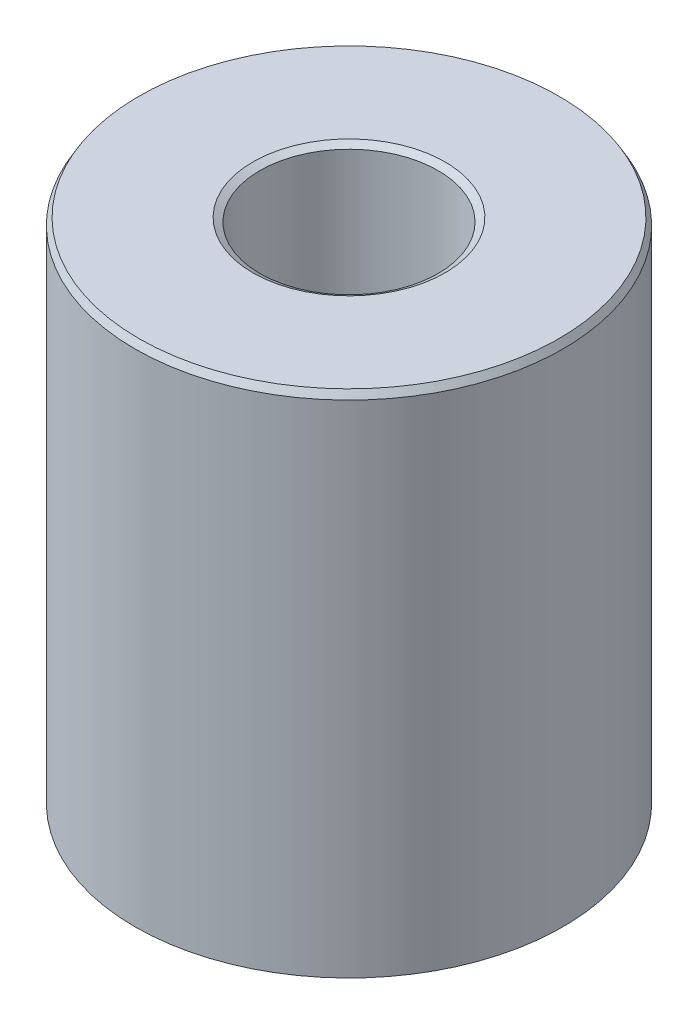
ISO-10303-21;
HEADER;
FILE_DESCRIPTION(('STEP AP214'),'2;1');
FILE_NAME('part.step','',(''),(''),'','','');
FILE_SCHEMA(('AUTOMOTIVE_DESIGN { 1 0 10303 214 1 1 1 1 }'));
ENDSEC;
DATA;
#1=APPLICATION_CONTEXT('core data for automotive mechanical design processes');
#2=APPLICATION_PROTOCOL_DEFINITION('international standard','automotive_design',2000,#1);
#3=PRODUCT_CONTEXT('',#1,'mechanical');
#4=PRODUCT('Part','Part','',(#3));
#5=PRODUCT_RELATED_PRODUCT_CATEGORY('part','',(#4));
#6=PRODUCT_DEFINITION_FORMATION('','',#4);
#7=PRODUCT_DEFINITION_CONTEXT('part definition',#1,'design');
#8=PRODUCT_DEFINITION('design','',#6,#7);
#9=PRODUCT_DEFINITION_SHAPE('','',#8);
#10=(LENGTH_UNIT() NAMED_UNIT(*) SI_UNIT(.MILLI.,.METRE.));
#11=(NAMED_UNIT(*) PLANE_ANGLE_UNIT() SI_UNIT($,.RADIAN.));
#12=(NAMED_UNIT(*) SI_UNIT($,.STERADIAN.) SOLID_ANGLE_UNIT());
#13=UNCERTAINTY_MEASURE_WITH_UNIT(LENGTH_MEASURE(1.E-05),#10,'distance_accuracy_value','');
#14=(GEOMETRIC_REPRESENTATION_CONTEXT(3) GLOBAL_UNCERTAINTY_ASSIGNED_CONTEXT((#13)) GLOBAL_UNIT_ASSIGNED_CONTEXT((#10,
#11,#12)) REPRESENTATION_CONTEXT('',''));
#15=CARTESIAN_POINT('',(0.,0.,0.));
#16=DIRECTION('',(0.,0.,1.));
#17=DIRECTION('',(1.,0.,0.));
#18=AXIS2_PLACEMENT_3D('',#15,#16,#17);
#19=CARTESIAN_POINT('',(0.,101.568319174673,0.));
#20=DIRECTION('',(0.,-1.,0.));
#21=DIRECTION('',(0.,0.,-1.));
#22=AXIS2_PLACEMENT_3D('',#19,#20,#21);
#23=CYLINDRICAL_SURFACE('',#22,42.5);
#24=CARTESIAN_POINT('',(0.,0.796338501359004,0.));
#25=DIRECTION('',(0.,1.,0.));
#26=DIRECTION('',(0.,0.,1.));
#27=AXIS2_PLACEMENT_3D('',#24,#25,#26);
#28=CIRCLE('',#27,42.5);
#29=CARTESIAN_POINT('',(0.,0.796338501359004,42.5));
#30=VERTEX_POINT('',#29);
#31=EDGE_CURVE('E10',#30,#30,#28,.T.);
#32=ORIENTED_EDGE('',*,*,#31,.T.);
#33=EDGE_LOOP('',(#32));
#34=FACE_BOUND('',#33,.T.);
#35=CARTESIAN_POINT('',(0.,100.189020430296,0.));
#36=DIRECTION('',(0.,1.,0.));
#37=DIRECTION('',(0.,0.,1.));
#38=AXIS2_PLACEMENT_3D('',#35,#36,#37);
#39=CIRCLE('',#38,42.5);
#40=CARTESIAN_POINT('',(0.,100.189020430296,42.5));
#41=VERTEX_POINT('',#40);
#42=EDGE_CURVE('E50',#41,#41,#39,.F.);
#43=ORIENTED_EDGE('',*,*,#42,.T.);
#44=EDGE_LOOP('',(#43));
#45=FACE_BOUND('',#44,.T.);
#46=ADVANCED_FACE('F39',(#34,#45),#23,.T.);
#47=CARTESIAN_POINT('',(0.,101.568319174673,0.));
#48=DIRECTION('',(0.,1.,0.));
#49=DIRECTION('',(0.,0.,1.));
#50=AXIS2_PLACEMENT_3D('',#47,#48,#49);
#51=PLANE('',#50);
#52=CARTESIAN_POINT('',(0.,101.568319174673,0.));
#53=DIRECTION('',(0.,1.,0.));
#54=DIRECTION('',(0.,0.,1.));
#55=AXIS2_PLACEMENT_3D('',#52,#53,#54);
#56=CIRCLE('',#55,19.0885560058436);
#57=CARTESIAN_POINT('',(0.,101.568319174673,19.0885560058436));
#58=VERTEX_POINT('',#57);
#59=EDGE_CURVE('E58',#58,#58,#56,.F.);
#60=ORIENTED_EDGE('',*,*,#59,.T.);
#61=EDGE_LOOP('',(#60));
#62=FACE_BOUND('',#61,.T.);
#63=CARTESIAN_POINT('',(0.,101.568319174673,0.));
#64=DIRECTION('',(0.,1.,0.));
#65=DIRECTION('',(0.,0.,1.));
#66=AXIS2_PLACEMENT_3D('',#63,#64,#65);
#67=CIRCLE('',#66,41.7036614986409);
#68=CARTESIAN_POINT('',(0.,101.568319174673,41.7036614986409));
#69=VERTEX_POINT('',#68);
#70=EDGE_CURVE('E61',#69,#69,#67,.T.);
#71=ORIENTED_EDGE('',*,*,#70,.T.);
#72=EDGE_LOOP('',(#71));
#73=FACE_BOUND('',#72,.T.);
#74=ADVANCED_FACE('F88',(#62,#73),#51,.T.);
#75=CARTESIAN_POINT('',(0.,0.,0.));
#76=DIRECTION('',(0.,1.,0.));
#77=DIRECTION('',(0.,0.,1.));
#78=AXIS2_PLACEMENT_3D('',#75,#76,#77);
#79=PLANE('',#78);
#80=CARTESIAN_POINT('',(0.,0.,0.));
#81=DIRECTION('',(0.,1.,0.));
#82=DIRECTION('',(0.,0.,1.));
#83=AXIS2_PLACEMENT_3D('',#80,#81,#82);
#84=CIRCLE('',#83,18.5055957628256);
#85=CARTESIAN_POINT('',(0.,0.,18.5055957628256));
#86=VERTEX_POINT('',#85);
#87=EDGE_CURVE('E51',#86,#86,#84,.T.);
#88=ORIENTED_EDGE('',*,*,#87,.T.);
#89=EDGE_LOOP('',(#88));
#90=FACE_BOUND('',#89,.T.);
#91=CARTESIAN_POINT('',(0.,0.,0.));
#92=DIRECTION('',(0.,1.,0.));
#93=DIRECTION('',(0.,0.,1.));
#94=AXIS2_PLACEMENT_3D('',#91,#92,#93);
#95=CIRCLE('',#94,41.1207012556229);
#96=CARTESIAN_POINT('',(0.,0.,41.1207012556229));
#97=VERTEX_POINT('',#96);
#98=EDGE_CURVE('E54',#97,#97,#95,.F.);
#99=ORIENTED_EDGE('',*,*,#98,.T.);
#100=EDGE_LOOP('',(#99));
#101=FACE_BOUND('',#100,.T.);
#102=ADVANCED_FACE('F83',(#90,#101),#79,.F.);
#103=CARTESIAN_POINT('',(0.,101.568319174673,0.));
#104=DIRECTION('',(0.,-1.,0.));
#105=DIRECTION('',(0.,0.,-1.));
#106=AXIS2_PLACEMENT_3D('',#103,#104,#105);
#107=CYLINDRICAL_SURFACE('',#106,17.7092572614666);
#108=CARTESIAN_POINT('',(0.,100.771980673314,0.));
#109=DIRECTION('',(0.,1.,0.));
#110=DIRECTION('',(0.,0.,1.));
#111=AXIS2_PLACEMENT_3D('',#108,#109,#110);
#112=CIRCLE('',#111,17.7092572614666);
#113=CARTESIAN_POINT('',(0.,100.771980673314,17.7092572614666));
#114=VERTEX_POINT('',#113);
#115=EDGE_CURVE('E67',#114,#114,#112,.T.);
#116=ORIENTED_EDGE('',*,*,#115,.T.);
#117=EDGE_LOOP('',(#116));
#118=FACE_BOUND('',#117,.T.);
#119=CARTESIAN_POINT('',(0.,1.3792987443771,0.));
#120=DIRECTION('',(0.,1.,0.));
#121=DIRECTION('',(0.,0.,1.));
#122=AXIS2_PLACEMENT_3D('',#119,#120,#121);
#123=CIRCLE('',#122,17.7092572614666);
#124=CARTESIAN_POINT('',(0.,1.3792987443771,17.7092572614666));
#125=VERTEX_POINT('',#124);
#126=EDGE_CURVE('E69',#125,#125,#123,.F.);
#127=ORIENTED_EDGE('',*,*,#126,.T.);
#128=EDGE_LOOP('',(#127));
#129=FACE_BOUND('',#128,.T.);
#130=ADVANCED_FACE('F71',(#118,#129),#107,.F.);
#131=CARTESIAN_POINT('',(0.,100.771980673314,0.));
#132=DIRECTION('',(0.,1.,0.));
#133=DIRECTION('',(0.,0.,1.));
#134=AXIS2_PLACEMENT_3D('',#131,#132,#133);
#135=CONICAL_SURFACE('',#134,17.7092572614666,1.04719755119659);
#136=ORIENTED_EDGE('',*,*,#59,.F.);
#137=EDGE_LOOP('',(#136));
#138=FACE_BOUND('',#137,.T.);
#139=ORIENTED_EDGE('',*,*,#115,.F.);
#140=EDGE_LOOP('',(#139));
#141=FACE_BOUND('',#140,.T.);
#142=ADVANCED_FACE('F77',(#138,#141),#135,.F.);
#143=CARTESIAN_POINT('',(0.,0.,0.));
#144=DIRECTION('',(0.,-1.,0.));
#145=DIRECTION('',(0.,0.,-1.));
#146=AXIS2_PLACEMENT_3D('',#143,#144,#145);
#147=CONICAL_SURFACE('',#146,18.5055957628256,0.523598775598294);
#148=ORIENTED_EDGE('',*,*,#126,.F.);
#149=EDGE_LOOP('',(#148));
#150=FACE_BOUND('',#149,.T.);
#151=ORIENTED_EDGE('',*,*,#87,.F.);
#152=EDGE_LOOP('',(#151));
#153=FACE_BOUND('',#152,.T.);
#154=ADVANCED_FACE('F73',(#150,#153),#147,.F.);
#155=CARTESIAN_POINT('',(0.,0.796338501359004,0.));
#156=DIRECTION('',(0.,1.,0.));
#157=DIRECTION('',(0.,0.,1.));
#158=AXIS2_PLACEMENT_3D('',#155,#156,#157);
#159=CONICAL_SURFACE('',#158,42.5,1.0471975511966);
#160=ORIENTED_EDGE('',*,*,#98,.F.);
#161=EDGE_LOOP('',(#160));
#162=FACE_BOUND('',#161,.T.);
#163=ORIENTED_EDGE('',*,*,#31,.F.);
#164=EDGE_LOOP('',(#163));
#165=FACE_BOUND('',#164,.T.);
#166=ADVANCED_FACE('F76',(#162,#165),#159,.T.);
#167=CARTESIAN_POINT('',(0.,101.568319174673,0.));
#168=DIRECTION('',(0.,-1.,0.));
#169=DIRECTION('',(0.,0.,-1.));
#170=AXIS2_PLACEMENT_3D('',#167,#168,#169);
#171=CONICAL_SURFACE('',#170,41.7036614986409,0.523598775598304);
#172=ORIENTED_EDGE('',*,*,#42,.F.);
#173=EDGE_LOOP('',(#172));
#174=FACE_BOUND('',#173,.T.);
#175=ORIENTED_EDGE('',*,*,#70,.F.);
#176=EDGE_LOOP('',(#175));
#177=FACE_BOUND('',#176,.T.);
#178=ADVANCED_FACE('F45',(#174,#177),#171,.T.);
#179=CLOSED_SHELL('',(#46,#74,#102,#130,#142,#154,#166,#178));
#180=MANIFOLD_SOLID_BREP('B2',#179);
#181=ADVANCED_BREP_SHAPE_REPRESENTATION('',(#18,#180),#14);
#182=SHAPE_DEFINITION_REPRESENTATION(#9,#181);
ENDSEC;
END-ISO-10303-21;
